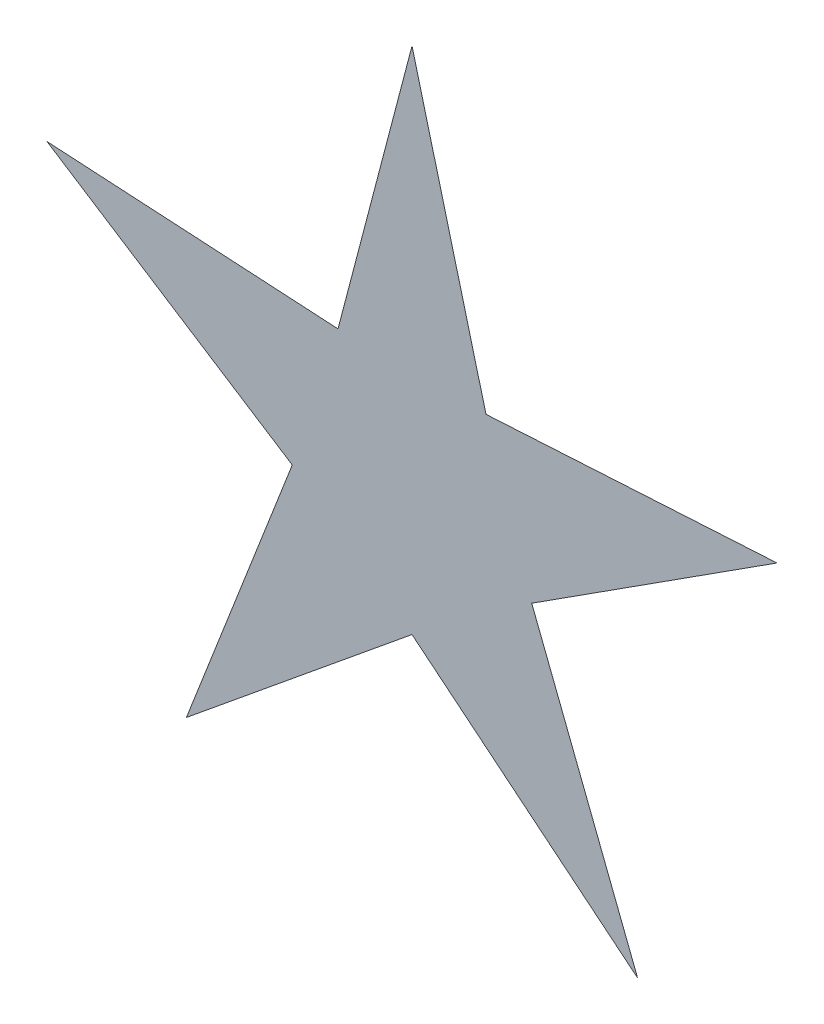
ISO-10303-21;
HEADER;
FILE_DESCRIPTION(('STEP AP214'),'2;1');
FILE_NAME('part.step','',(''),(''),'','','');
FILE_SCHEMA(('AUTOMOTIVE_DESIGN { 1 0 10303 214 1 1 1 1 }'));
ENDSEC;
DATA;
#1=APPLICATION_CONTEXT('core data for automotive mechanical design processes');
#2=APPLICATION_PROTOCOL_DEFINITION('international standard','automotive_design',2000,#1);
#3=PRODUCT_CONTEXT('',#1,'mechanical');
#4=PRODUCT('Part','Part','',(#3));
#5=PRODUCT_RELATED_PRODUCT_CATEGORY('part','',(#4));
#6=PRODUCT_DEFINITION_FORMATION('','',#4);
#7=PRODUCT_DEFINITION_CONTEXT('part definition',#1,'design');
#8=PRODUCT_DEFINITION('design','',#6,#7);
#9=PRODUCT_DEFINITION_SHAPE('','',#8);
#10=(LENGTH_UNIT() NAMED_UNIT(*) SI_UNIT(.MILLI.,.METRE.));
#11=(NAMED_UNIT(*) PLANE_ANGLE_UNIT() SI_UNIT($,.RADIAN.));
#12=(NAMED_UNIT(*) SI_UNIT($,.STERADIAN.) SOLID_ANGLE_UNIT());
#13=UNCERTAINTY_MEASURE_WITH_UNIT(LENGTH_MEASURE(1.E-05),#10,'distance_accuracy_value','');
#14=(GEOMETRIC_REPRESENTATION_CONTEXT(3) GLOBAL_UNCERTAINTY_ASSIGNED_CONTEXT((#13)) GLOBAL_UNIT_ASSIGNED_CONTEXT((#10,
#11,#12)) REPRESENTATION_CONTEXT('',''));
#15=CARTESIAN_POINT('',(0.,0.,0.));
#16=DIRECTION('',(0.,0.,1.));
#17=DIRECTION('',(1.,0.,0.));
#18=AXIS2_PLACEMENT_3D('',#15,#16,#17);
#19=CARTESIAN_POINT('',(0.,0.,10.));
#20=DIRECTION('',(0.,0.,-1.));
#21=DIRECTION('',(-1.,0.,0.));
#22=AXIS2_PLACEMENT_3D('',#19,#20,#21);
#23=PLANE('',#22);
#24=DIRECTION('',(0.253817936017342,-0.967252012329722,0.));
#25=VECTOR('',#24,1.);
#26=CARTESIAN_POINT('',(13.4118151398818,3.51941292823128,10.));
#27=LINE('',#26,#25);
#28=CARTESIAN_POINT('',(0.,54.6292965975974,10.));
#29=VERTEX_POINT('',#28);
#30=CARTESIAN_POINT('',(10.5315735309959,14.4954674021759,10.));
#31=VERTEX_POINT('',#30);
#32=EDGE_CURVE('E11',#29,#31,#27,.T.);
#33=ORIENTED_EDGE('',*,*,#32,.F.);
#34=DIRECTION('',(0.253817936017342,0.967252012329722,0.));
#35=VECTOR('',#34,1.);
#36=CARTESIAN_POINT('',(-13.4118151398818,3.51941292823128,10.));
#37=LINE('',#36,#35);
#38=CARTESIAN_POINT('',(-10.5315735309961,14.4954674021758,10.));
#39=VERTEX_POINT('',#38);
#40=EDGE_CURVE('E46',#39,#29,#37,.T.);
#41=ORIENTED_EDGE('',*,*,#40,.F.);
#42=DIRECTION('',(0.998345384932314,-0.0575021076513682,0.));
#43=VECTOR('',#42,1.);
#44=CARTESIAN_POINT('',(0.797318204710897,13.842952589177,10.));
#45=LINE('',#44,#43);
#46=CARTESIAN_POINT('',(-51.9555485097657,16.8813810394069,10.));
#47=VERTEX_POINT('',#46);
#48=EDGE_CURVE('E55',#47,#39,#45,.T.);
#49=ORIENTED_EDGE('',*,*,#48,.F.);
#50=DIRECTION('',(-0.841477273519252,0.540292511655127,0.));
#51=VECTOR('',#50,1.);
#52=CARTESIAN_POINT('',(-7.49163940256643,-11.6678357790843,10.));
#53=LINE('',#52,#51);
#54=CARTESIAN_POINT('',(-17.0404439281704,-5.53677586481508,10.));
#55=VERTEX_POINT('',#54);
#56=EDGE_CURVE('E139',#55,#47,#53,.T.);
#57=ORIENTED_EDGE('',*,*,#56,.F.);
#58=DIRECTION('',(0.36319344438242,0.931713755376421,0.));
#59=VECTOR('',#58,1.);
#60=CARTESIAN_POINT('',(-12.9190453895215,5.03600227653338,10.));
#61=LINE('',#60,#59);
#62=CARTESIAN_POINT('',(-32.1102948831789,-44.1960293382059,10.));
#63=VERTEX_POINT('',#62);
#64=EDGE_CURVE('E135',#63,#55,#61,.T.);
#65=ORIENTED_EDGE('',*,*,#64,.F.);
#66=DIRECTION('',(-0.773879491812827,-0.633332876259808,0.));
#67=VECTOR('',#66,1.);
#68=CARTESIAN_POINT('',(8.78172735763786,-10.7305320148574,10.));
#69=LINE('',#68,#67);
#70=CARTESIAN_POINT('',(1.33573707650214E-13,-17.9173830747216,10.));
#71=VERTEX_POINT('',#70);
#72=EDGE_CURVE('E123',#71,#63,#69,.T.);
#73=ORIENTED_EDGE('',*,*,#72,.F.);
#74=DIRECTION('',(-0.773879491812836,0.633332876259797,0.));
#75=VECTOR('',#74,1.);
#76=CARTESIAN_POINT('',(-8.78172735763771,-10.7305320148575,10.));
#77=LINE('',#76,#75);
#78=CARTESIAN_POINT('',(32.1102948831795,-44.1960293382055,10.));
#79=VERTEX_POINT('',#78);
#80=EDGE_CURVE('E119',#79,#71,#77,.T.);
#81=ORIENTED_EDGE('',*,*,#80,.F.);
#82=DIRECTION('',(0.363193444382434,-0.931713755376416,0.));
#83=VECTOR('',#82,1.);
#84=CARTESIAN_POINT('',(12.9190453895214,5.03600227653357,10.));
#85=LINE('',#84,#83);
#86=CARTESIAN_POINT('',(17.0404439281705,-5.53677586481484,10.));
#87=VERTEX_POINT('',#86);
#88=EDGE_CURVE('E101',#87,#79,#85,.T.);
#89=ORIENTED_EDGE('',*,*,#88,.F.);
#90=DIRECTION('',(-0.841477273519245,-0.540292511655139,0.));
#91=VECTOR('',#90,1.);
#92=CARTESIAN_POINT('',(7.49163940256659,-11.6678357790842,10.));
#93=LINE('',#92,#91);
#94=CARTESIAN_POINT('',(51.9555485097654,16.8813810394077,10.));
#95=VERTEX_POINT('',#94);
#96=EDGE_CURVE('E97',#95,#87,#93,.T.);
#97=ORIENTED_EDGE('',*,*,#96,.F.);
#98=DIRECTION('',(0.998345384932313,0.0575021076513824,0.));
#99=VECTOR('',#98,1.);
#100=CARTESIAN_POINT('',(-0.797318204711092,13.842952589177,10.));
#101=LINE('',#100,#99);
#102=EDGE_CURVE('E110',#31,#95,#101,.T.);
#103=ORIENTED_EDGE('',*,*,#102,.F.);
#104=EDGE_LOOP('',(#33,#41,#49,#57,#65,#73,#81,#89,#97,#103));
#105=FACE_BOUND('',#104,.T.);
#106=ADVANCED_FACE('F38',(#105),#23,.F.);
#107=CARTESIAN_POINT('',(0.,59.9584100516507,10.9178264740633));
#108=DIRECTION('',(0.543102875713795,0.142516375465309,-0.827483141287867));
#109=DIRECTION('',(-0.836016829672081,0.,-0.548703800337708));
#110=AXIS2_PLACEMENT_3D('',#107,#108,#109);
#111=PLANE('',#110);
#112=DIRECTION('',(-0.520398622341444,-0.716267255228868,-0.464915576155533));
#113=VECTOR('',#112,1.);
#114=CARTESIAN_POINT('',(11.730030504929,16.1450019135596,11.0706817631966));
#115=LINE('',#114,#113);
#116=CARTESIAN_POINT('',(0.,0.,0.591265299747724));
#117=VERTEX_POINT('',#116);
#118=EDGE_CURVE('E108',#31,#117,#115,.T.);
#119=ORIENTED_EDGE('',*,*,#118,.T.);
#120=DIRECTION('',(0.,-0.98549063556804,-0.16972980647989));
#121=VECTOR('',#120,1.);
#122=CARTESIAN_POINT('',(0.,59.9584100516507,10.9178264740633));
#123=LINE('',#122,#121);
#124=EDGE_CURVE('E147',#29,#117,#123,.T.);
#125=ORIENTED_EDGE('',*,*,#124,.F.);
#126=ORIENTED_EDGE('',*,*,#32,.T.);
#127=EDGE_LOOP('',(#119,#125,#126));
#128=FACE_BOUND('',#127,.T.);
#129=ADVANCED_FACE('F152',(#128),#111,.T.);
#130=CARTESIAN_POINT('',(-12.0605033159076,59.9584100516507,18.8335092313348));
#131=DIRECTION('',(-0.543102875713795,0.142516375465309,-0.827483141287867));
#132=DIRECTION('',(-0.836016829672081,0.,0.548703800337708));
#133=AXIS2_PLACEMENT_3D('',#130,#131,#132);
#134=PLANE('',#133);
#135=DIRECTION('',(-0.520398622341444,0.716267255228868,0.464915576155533));
#136=VECTOR('',#135,1.);
#137=CARTESIAN_POINT('',(-11.730030504929,16.1450019135596,11.0706817631966));
#138=LINE('',#137,#136);
#139=EDGE_CURVE('E144',#117,#39,#138,.T.);
#140=ORIENTED_EDGE('',*,*,#139,.T.);
#141=ORIENTED_EDGE('',*,*,#40,.T.);
#142=ORIENTED_EDGE('',*,*,#124,.T.);
#143=EDGE_LOOP('',(#140,#141,#142));
#144=FACE_BOUND('',#143,.T.);
#145=ADVANCED_FACE('F155',(#144),#134,.T.);
#146=CARTESIAN_POINT('',(-57.0238365863193,18.5281676616616,10.9178264740633));
#147=DIRECTION('',(0.0322868907244171,0.560561510961744,-0.827483141287867));
#148=DIRECTION('',(-0.258343407952137,-0.795099253592049,-0.548703800337708));
#149=AXIS2_PLACEMENT_3D('',#146,#147,#148);
#150=PLANE('',#149);
#151=ORIENTED_EDGE('',*,*,#139,.F.);
#152=DIRECTION('',(0.937257290704838,-0.30453335418789,-0.16972980647989));
#153=VECTOR('',#152,1.);
#154=CARTESIAN_POINT('',(-57.0238365863193,18.5281676616616,10.9178264740633));
#155=LINE('',#154,#153);
#156=EDGE_CURVE('E140',#47,#117,#155,.T.);
#157=ORIENTED_EDGE('',*,*,#156,.F.);
#158=ORIENTED_EDGE('',*,*,#48,.T.);
#159=EDGE_LOOP('',(#151,#157,#158));
#160=FACE_BOUND('',#159,.T.);
#161=ADVANCED_FACE('F145',(#160),#150,.T.);
#162=CARTESIAN_POINT('',(-60.7507370716501,7.05794739326839,18.8335092313348));
#163=DIRECTION('',(-0.303369145854515,-0.472481546970742,-0.827483141287867));
#164=DIRECTION('',(-0.258343407952137,-0.795099253592049,0.548703800337708));
#165=AXIS2_PLACEMENT_3D('',#162,#163,#164);
#166=PLANE('',#165);
#167=DIRECTION('',(-0.842022658647074,-0.273589746468835,0.464915576155533));
#168=VECTOR('',#167,1.);
#169=CARTESIAN_POINT('',(-18.9795880460482,-6.16684198254778,11.0706817631966));
#170=LINE('',#169,#168);
#171=EDGE_CURVE('E132',#117,#55,#170,.T.);
#172=ORIENTED_EDGE('',*,*,#171,.T.);
#173=ORIENTED_EDGE('',*,*,#56,.T.);
#174=ORIENTED_EDGE('',*,*,#156,.T.);
#175=EDGE_LOOP('',(#172,#173,#174));
#176=FACE_BOUND('',#175,.T.);
#177=ADVANCED_FACE('F149',(#176),#166,.T.);
#178=CARTESIAN_POINT('',(-35.2426691792648,-48.5073726874873,10.9178264740633));
#179=DIRECTION('',(-0.523148479855052,0.203929691094042,-0.827483141287867));
#180=DIRECTION('',(0.676351822788182,-0.491398363149554,-0.548703800337708));
#181=AXIS2_PLACEMENT_3D('',#178,#179,#180);
#182=PLANE('',#181);
#183=ORIENTED_EDGE('',*,*,#171,.F.);
#184=DIRECTION('',(0.579256861859226,0.797278671971916,-0.16972980647989));
#185=VECTOR('',#184,1.);
#186=CARTESIAN_POINT('',(-35.2426691792648,-48.5073726874873,10.9178264740633));
#187=LINE('',#186,#185);
#188=EDGE_CURVE('E124',#63,#117,#187,.T.);
#189=ORIENTED_EDGE('',*,*,#188,.F.);
#190=ORIENTED_EDGE('',*,*,#64,.T.);
#191=EDGE_LOOP('',(#183,#189,#190));
#192=FACE_BOUND('',#191,.T.);
#193=ADVANCED_FACE('F133',(#192),#182,.T.);
#194=CARTESIAN_POINT('',(-25.4855170359802,-55.5963586718022,18.8335092313348));
#195=DIRECTION('',(0.355610432437682,-0.434526030550355,-0.827483141287867));
#196=DIRECTION('',(0.676351822788182,-0.491398363149554,0.548703800337708));
#197=AXIS2_PLACEMENT_3D('',#194,#195,#196);
#198=PLANE('',#197);
#199=DIRECTION('',(0.,-0.885355017520073,0.464915576155533));
#200=VECTOR('',#199,1.);
#201=CARTESIAN_POINT('',(1.38777878078145E-13,-19.9563198620239,11.0706817631966));
#202=LINE('',#201,#200);
#203=EDGE_CURVE('E116',#117,#71,#202,.T.);
#204=ORIENTED_EDGE('',*,*,#203,.T.);
#205=ORIENTED_EDGE('',*,*,#72,.T.);
#206=ORIENTED_EDGE('',*,*,#188,.T.);
#207=EDGE_LOOP('',(#204,#205,#206));
#208=FACE_BOUND('',#207,.T.);
#209=ADVANCED_FACE('F142',(#208),#198,.T.);
#210=CARTESIAN_POINT('',(35.2426691792655,-48.5073726874868,10.9178264740633));
#211=DIRECTION('',(-0.355610432437676,-0.43452603055036,-0.827483141287867));
#212=DIRECTION('',(0.676351822788175,0.491398363149563,-0.548703800337708));
#213=AXIS2_PLACEMENT_3D('',#210,#211,#212);
#214=PLANE('',#213);
#215=ORIENTED_EDGE('',*,*,#203,.F.);
#216=DIRECTION('',(-0.579256861859237,0.797278671971907,-0.16972980647989));
#217=VECTOR('',#216,1.);
#218=CARTESIAN_POINT('',(35.2426691792655,-48.5073726874868,10.9178264740633));
#219=LINE('',#218,#217);
#220=EDGE_CURVE('E102',#79,#117,#219,.T.);
#221=ORIENTED_EDGE('',*,*,#220,.F.);
#222=ORIENTED_EDGE('',*,*,#80,.T.);
#223=EDGE_LOOP('',(#215,#221,#222));
#224=FACE_BOUND('',#223,.T.);
#225=ADVANCED_FACE('F117',(#224),#214,.T.);
#226=CARTESIAN_POINT('',(44.9998213225501,-41.4183867031718,18.8335092313348));
#227=DIRECTION('',(0.523148479855049,0.20392969109405,-0.827483141287867));
#228=DIRECTION('',(0.676351822788175,0.491398363149563,0.548703800337708));
#229=AXIS2_PLACEMENT_3D('',#226,#227,#228);
#230=PLANE('',#229);
#231=DIRECTION('',(0.842022658647078,-0.273589746468823,0.464915576155533));
#232=VECTOR('',#231,1.);
#233=CARTESIAN_POINT('',(18.9795880460483,-6.1668419825475,11.0706817631966));
#234=LINE('',#233,#232);
#235=EDGE_CURVE('E92',#117,#87,#234,.T.);
#236=ORIENTED_EDGE('',*,*,#235,.T.);
#237=ORIENTED_EDGE('',*,*,#88,.T.);
#238=ORIENTED_EDGE('',*,*,#220,.T.);
#239=EDGE_LOOP('',(#236,#237,#238));
#240=FACE_BOUND('',#239,.T.);
#241=ADVANCED_FACE('F127',(#240),#230,.T.);
#242=CARTESIAN_POINT('',(57.0238365863191,18.5281676616624,10.9178264740633));
#243=DIRECTION('',(0.303369145854522,-0.472481546970737,-0.827483141287867));
#244=DIRECTION('',(-0.258343407952148,0.795099253592045,-0.548703800337708));
#245=AXIS2_PLACEMENT_3D('',#242,#243,#244);
#246=PLANE('',#245);
#247=ORIENTED_EDGE('',*,*,#235,.F.);
#248=DIRECTION('',(-0.937257290704833,-0.304533354187903,-0.16972980647989));
#249=VECTOR('',#248,1.);
#250=CARTESIAN_POINT('',(57.0238365863191,18.5281676616624,10.9178264740633));
#251=LINE('',#250,#249);
#252=EDGE_CURVE('E95',#95,#117,#251,.T.);
#253=ORIENTED_EDGE('',*,*,#252,.F.);
#254=ORIENTED_EDGE('',*,*,#96,.T.);
#255=EDGE_LOOP('',(#247,#253,#254));
#256=FACE_BOUND('',#255,.T.);
#257=ADVANCED_FACE('F94',(#256),#246,.T.);
#258=CARTESIAN_POINT('',(53.2969361009881,29.9983879300555,18.8335092313348));
#259=DIRECTION('',(-0.0322868907244251,0.560561510961743,-0.827483141287867));
#260=DIRECTION('',(-0.258343407952148,0.795099253592045,0.548703800337708));
#261=AXIS2_PLACEMENT_3D('',#258,#259,#260);
#262=PLANE('',#261);
#263=ORIENTED_EDGE('',*,*,#118,.F.);
#264=ORIENTED_EDGE('',*,*,#102,.T.);
#265=ORIENTED_EDGE('',*,*,#252,.T.);
#266=EDGE_LOOP('',(#263,#264,#265));
#267=FACE_BOUND('',#266,.T.);
#268=ADVANCED_FACE('F106',(#267),#262,.T.);
#269=CLOSED_SHELL('',(#106,#129,#145,#161,#177,#193,#209,#225,#241,#257,#268));
#270=MANIFOLD_SOLID_BREP('B2',#269);
#271=ADVANCED_BREP_SHAPE_REPRESENTATION('',(#18,#270),#14);
#272=SHAPE_DEFINITION_REPRESENTATION(#9,#271);
ENDSEC;
END-ISO-10303-21;
